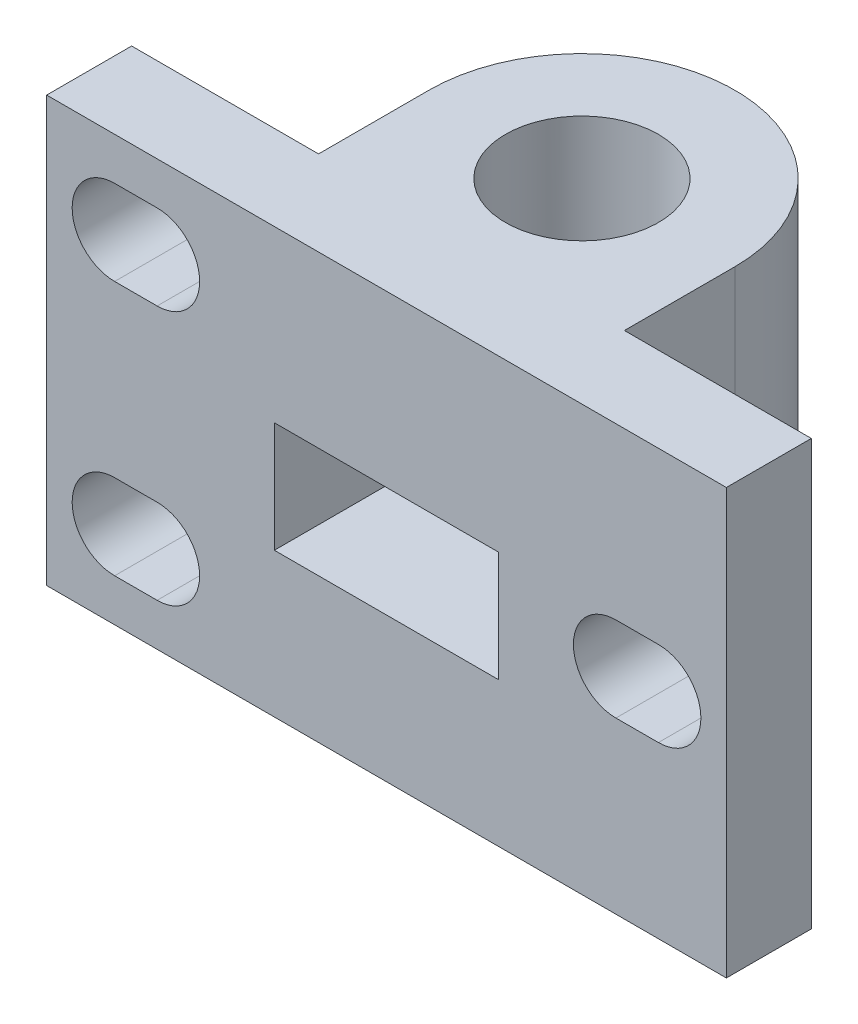
ISO-10303-21;
HEADER;
FILE_DESCRIPTION(('STEP AP214'),'2;1');
FILE_NAME('part.step','',(''),(''),'','','');
FILE_SCHEMA(('AUTOMOTIVE_DESIGN { 1 0 10303 214 1 1 1 1 }'));
ENDSEC;
DATA;
#1=APPLICATION_CONTEXT('core data for automotive mechanical design processes');
#2=APPLICATION_PROTOCOL_DEFINITION('international standard','automotive_design',2000,#1);
#3=PRODUCT_CONTEXT('',#1,'mechanical');
#4=PRODUCT('Part','Part','',(#3));
#5=PRODUCT_RELATED_PRODUCT_CATEGORY('part','',(#4));
#6=PRODUCT_DEFINITION_FORMATION('','',#4);
#7=PRODUCT_DEFINITION_CONTEXT('part definition',#1,'design');
#8=PRODUCT_DEFINITION('design','',#6,#7);
#9=PRODUCT_DEFINITION_SHAPE('','',#8);
#10=(LENGTH_UNIT() NAMED_UNIT(*) SI_UNIT(.MILLI.,.METRE.));
#11=(NAMED_UNIT(*) PLANE_ANGLE_UNIT() SI_UNIT($,.RADIAN.));
#12=(NAMED_UNIT(*) SI_UNIT($,.STERADIAN.) SOLID_ANGLE_UNIT());
#13=UNCERTAINTY_MEASURE_WITH_UNIT(LENGTH_MEASURE(1.E-05),#10,'distance_accuracy_value','');
#14=(GEOMETRIC_REPRESENTATION_CONTEXT(3) GLOBAL_UNCERTAINTY_ASSIGNED_CONTEXT((#13)) GLOBAL_UNIT_ASSIGNED_CONTEXT((#10,
#11,#12)) REPRESENTATION_CONTEXT('',''));
#15=CARTESIAN_POINT('',(0.,0.,0.));
#16=DIRECTION('',(0.,0.,1.));
#17=DIRECTION('',(1.,0.,0.));
#18=AXIS2_PLACEMENT_3D('',#15,#16,#17);
#19=CARTESIAN_POINT('',(0.,25.,-11.5));
#20=DIRECTION('',(0.,-1.,0.));
#21=DIRECTION('',(0.,0.,-1.));
#22=AXIS2_PLACEMENT_3D('',#19,#20,#21);
#23=CYLINDRICAL_SURFACE('',#22,4.5);
#24=CARTESIAN_POINT('',(0.,0.,-11.5));
#25=DIRECTION('',(0.,1.,0.));
#26=DIRECTION('',(0.,0.,-1.));
#27=AXIS2_PLACEMENT_3D('',#24,#25,#26);
#28=CIRCLE('',#27,4.5);
#29=CARTESIAN_POINT('',(0.,0.,-16.));
#30=VERTEX_POINT('',#29);
#31=EDGE_CURVE('E347',#30,#30,#28,.T.);
#32=ORIENTED_EDGE('',*,*,#31,.F.);
#33=EDGE_LOOP('',(#32));
#34=FACE_BOUND('',#33,.T.);
#35=CARTESIAN_POINT('',(0.,8.5,-11.5));
#36=DIRECTION('',(0.,1.,0.));
#37=DIRECTION('',(0.,0.,1.));
#38=AXIS2_PLACEMENT_3D('',#35,#36,#37);
#39=CIRCLE('',#38,4.5);
#40=CARTESIAN_POINT('',(0.,8.5,-7.));
#41=VERTEX_POINT('',#40);
#42=EDGE_CURVE('E37',#41,#41,#39,.T.);
#43=ORIENTED_EDGE('',*,*,#42,.T.);
#44=EDGE_LOOP('',(#43));
#45=FACE_BOUND('',#44,.T.);
#46=ADVANCED_FACE('F33',(#34,#45),#23,.F.);
#47=CARTESIAN_POINT('',(0.,25.,-11.5));
#48=DIRECTION('',(0.,1.,0.));
#49=DIRECTION('',(0.,0.,1.));
#50=AXIS2_PLACEMENT_3D('',#47,#48,#49);
#51=PLANE('',#50);
#52=DIRECTION('',(0.,0.,1.));
#53=VECTOR('',#52,1.);
#54=CARTESIAN_POINT('',(-20.,25.,0.));
#55=LINE('',#54,#53);
#56=CARTESIAN_POINT('',(-20.,25.,-4.99999999999999));
#57=VERTEX_POINT('',#56);
#58=CARTESIAN_POINT('',(-20.,25.,0.));
#59=VERTEX_POINT('',#58);
#60=EDGE_CURVE('E350',#57,#59,#55,.T.);
#61=ORIENTED_EDGE('',*,*,#60,.T.);
#62=DIRECTION('',(1.,0.,0.));
#63=VECTOR('',#62,1.);
#64=CARTESIAN_POINT('',(20.,25.,0.));
#65=LINE('',#64,#63);
#66=CARTESIAN_POINT('',(20.,25.,0.));
#67=VERTEX_POINT('',#66);
#68=EDGE_CURVE('E353',#59,#67,#65,.T.);
#69=ORIENTED_EDGE('',*,*,#68,.T.);
#70=DIRECTION('',(0.,0.,-1.));
#71=VECTOR('',#70,1.);
#72=CARTESIAN_POINT('',(20.,25.,0.));
#73=LINE('',#72,#71);
#74=CARTESIAN_POINT('',(20.,25.,-4.99999999999999));
#75=VERTEX_POINT('',#74);
#76=EDGE_CURVE('E356',#67,#75,#73,.T.);
#77=ORIENTED_EDGE('',*,*,#76,.T.);
#78=DIRECTION('',(-1.,0.,0.));
#79=VECTOR('',#78,1.);
#80=CARTESIAN_POINT('',(9.,25.,-5.));
#81=LINE('',#80,#79);
#82=CARTESIAN_POINT('',(9.,25.,-5.));
#83=VERTEX_POINT('',#82);
#84=EDGE_CURVE('E358',#75,#83,#81,.T.);
#85=ORIENTED_EDGE('',*,*,#84,.T.);
#86=DIRECTION('',(0.,0.,-1.));
#87=VECTOR('',#86,1.);
#88=CARTESIAN_POINT('',(9.,25.,-11.5));
#89=LINE('',#88,#87);
#90=CARTESIAN_POINT('',(9.,25.,-11.5));
#91=VERTEX_POINT('',#90);
#92=EDGE_CURVE('E360',#83,#91,#89,.T.);
#93=ORIENTED_EDGE('',*,*,#92,.T.);
#94=CARTESIAN_POINT('',(0.,25.,-11.5));
#95=DIRECTION('',(0.,1.,0.));
#96=DIRECTION('',(0.,0.,1.));
#97=AXIS2_PLACEMENT_3D('',#94,#95,#96);
#98=CIRCLE('',#97,9.);
#99=CARTESIAN_POINT('',(-9.,25.,-11.5));
#100=VERTEX_POINT('',#99);
#101=EDGE_CURVE('E362',#91,#100,#98,.T.);
#102=ORIENTED_EDGE('',*,*,#101,.T.);
#103=DIRECTION('',(0.,0.,1.));
#104=VECTOR('',#103,1.);
#105=CARTESIAN_POINT('',(-9.,25.,-11.5));
#106=LINE('',#105,#104);
#107=CARTESIAN_POINT('',(-9.,25.,-5.));
#108=VERTEX_POINT('',#107);
#109=EDGE_CURVE('E364',#100,#108,#106,.T.);
#110=ORIENTED_EDGE('',*,*,#109,.T.);
#111=DIRECTION('',(-1.,0.,0.));
#112=VECTOR('',#111,1.);
#113=CARTESIAN_POINT('',(-9.,25.,-5.));
#114=LINE('',#113,#112);
#115=EDGE_CURVE('E366',#108,#57,#114,.T.);
#116=ORIENTED_EDGE('',*,*,#115,.T.);
#117=EDGE_LOOP('',(#61,#69,#77,#85,#93,#102,#110,#116));
#118=FACE_BOUND('',#117,.T.);
#119=CARTESIAN_POINT('',(0.,25.,-11.5));
#120=DIRECTION('',(0.,1.,0.));
#121=DIRECTION('',(0.,0.,-1.));
#122=AXIS2_PLACEMENT_3D('',#119,#120,#121);
#123=CIRCLE('',#122,4.5);
#124=CARTESIAN_POINT('',(0.,25.,-16.));
#125=VERTEX_POINT('',#124);
#126=EDGE_CURVE('E343',#125,#125,#123,.T.);
#127=ORIENTED_EDGE('',*,*,#126,.F.);
#128=EDGE_LOOP('',(#127));
#129=FACE_BOUND('',#128,.T.);
#130=ADVANCED_FACE('F428',(#118,#129),#51,.T.);
#131=CARTESIAN_POINT('',(0.,0.,-11.5));
#132=DIRECTION('',(0.,1.,0.));
#133=DIRECTION('',(0.,0.,1.));
#134=AXIS2_PLACEMENT_3D('',#131,#132,#133);
#135=PLANE('',#134);
#136=DIRECTION('',(0.,0.,1.));
#137=VECTOR('',#136,1.);
#138=CARTESIAN_POINT('',(-20.,0.,0.));
#139=LINE('',#138,#137);
#140=CARTESIAN_POINT('',(-20.,0.,-4.99999999999999));
#141=VERTEX_POINT('',#140);
#142=CARTESIAN_POINT('',(-20.,0.,0.));
#143=VERTEX_POINT('',#142);
#144=EDGE_CURVE('E346',#141,#143,#139,.T.);
#145=ORIENTED_EDGE('',*,*,#144,.F.);
#146=DIRECTION('',(-1.,0.,0.));
#147=VECTOR('',#146,1.);
#148=CARTESIAN_POINT('',(-9.,0.,-5.));
#149=LINE('',#148,#147);
#150=CARTESIAN_POINT('',(-9.,0.,-5.));
#151=VERTEX_POINT('',#150);
#152=EDGE_CURVE('E354',#151,#141,#149,.T.);
#153=ORIENTED_EDGE('',*,*,#152,.F.);
#154=DIRECTION('',(0.,0.,1.));
#155=VECTOR('',#154,1.);
#156=CARTESIAN_POINT('',(-9.,0.,-11.5));
#157=LINE('',#156,#155);
#158=CARTESIAN_POINT('',(-9.,0.,-11.5));
#159=VERTEX_POINT('',#158);
#160=EDGE_CURVE('E381',#159,#151,#157,.T.);
#161=ORIENTED_EDGE('',*,*,#160,.F.);
#162=CARTESIAN_POINT('',(0.,0.,-11.5));
#163=DIRECTION('',(0.,1.,0.));
#164=DIRECTION('',(0.,0.,1.));
#165=AXIS2_PLACEMENT_3D('',#162,#163,#164);
#166=CIRCLE('',#165,9.);
#167=CARTESIAN_POINT('',(9.,0.,-11.5));
#168=VERTEX_POINT('',#167);
#169=EDGE_CURVE('E379',#168,#159,#166,.T.);
#170=ORIENTED_EDGE('',*,*,#169,.F.);
#171=DIRECTION('',(0.,0.,-1.));
#172=VECTOR('',#171,1.);
#173=CARTESIAN_POINT('',(9.,0.,-11.5));
#174=LINE('',#173,#172);
#175=CARTESIAN_POINT('',(9.,0.,-5.));
#176=VERTEX_POINT('',#175);
#177=EDGE_CURVE('E377',#176,#168,#174,.T.);
#178=ORIENTED_EDGE('',*,*,#177,.F.);
#179=DIRECTION('',(-1.,0.,0.));
#180=VECTOR('',#179,1.);
#181=CARTESIAN_POINT('',(9.,0.,-5.));
#182=LINE('',#181,#180);
#183=CARTESIAN_POINT('',(20.,0.,-4.99999999999999));
#184=VERTEX_POINT('',#183);
#185=EDGE_CURVE('E375',#184,#176,#182,.T.);
#186=ORIENTED_EDGE('',*,*,#185,.F.);
#187=DIRECTION('',(0.,0.,-1.));
#188=VECTOR('',#187,1.);
#189=CARTESIAN_POINT('',(20.,0.,0.));
#190=LINE('',#189,#188);
#191=CARTESIAN_POINT('',(20.,0.,0.));
#192=VERTEX_POINT('',#191);
#193=EDGE_CURVE('E373',#192,#184,#190,.T.);
#194=ORIENTED_EDGE('',*,*,#193,.F.);
#195=DIRECTION('',(1.,0.,0.));
#196=VECTOR('',#195,1.);
#197=CARTESIAN_POINT('',(20.,0.,0.));
#198=LINE('',#197,#196);
#199=EDGE_CURVE('E371',#143,#192,#198,.T.);
#200=ORIENTED_EDGE('',*,*,#199,.F.);
#201=EDGE_LOOP('',(#145,#153,#161,#170,#178,#186,#194,#200));
#202=FACE_BOUND('',#201,.T.);
#203=ORIENTED_EDGE('',*,*,#31,.T.);
#204=EDGE_LOOP('',(#203));
#205=FACE_BOUND('',#204,.T.);
#206=ADVANCED_FACE('F435',(#202,#205),#135,.F.);
#207=CARTESIAN_POINT('',(-20.,25.,0.));
#208=DIRECTION('',(1.,0.,0.));
#209=DIRECTION('',(0.,0.,-1.));
#210=AXIS2_PLACEMENT_3D('',#207,#208,#209);
#211=PLANE('',#210);
#212=ORIENTED_EDGE('',*,*,#144,.T.);
#213=DIRECTION('',(0.,-1.,0.));
#214=VECTOR('',#213,1.);
#215=CARTESIAN_POINT('',(-20.,25.,0.));
#216=LINE('',#215,#214);
#217=EDGE_CURVE('E11',#59,#143,#216,.T.);
#218=ORIENTED_EDGE('',*,*,#217,.F.);
#219=ORIENTED_EDGE('',*,*,#60,.F.);
#220=DIRECTION('',(0.,-1.,0.));
#221=VECTOR('',#220,1.);
#222=CARTESIAN_POINT('',(-20.,25.,-4.99999999999999));
#223=LINE('',#222,#221);
#224=EDGE_CURVE('E368',#57,#141,#223,.T.);
#225=ORIENTED_EDGE('',*,*,#224,.T.);
#226=EDGE_LOOP('',(#212,#218,#219,#225));
#227=FACE_BOUND('',#226,.T.);
#228=ADVANCED_FACE('F35',(#227),#211,.F.);
#229=CARTESIAN_POINT('',(20.,25.,0.));
#230=DIRECTION('',(0.,0.,-1.));
#231=DIRECTION('',(-1.,0.,0.));
#232=AXIS2_PLACEMENT_3D('',#229,#230,#231);
#233=PLANE('',#232);
#234=DIRECTION('',(1.,0.,0.));
#235=VECTOR('',#234,1.);
#236=CARTESIAN_POINT('',(-13.5,7.5,0.));
#237=LINE('',#236,#235);
#238=CARTESIAN_POINT('',(-16.,7.5,0.));
#239=VERTEX_POINT('',#238);
#240=CARTESIAN_POINT('',(-13.5,7.5,0.));
#241=VERTEX_POINT('',#240);
#242=EDGE_CURVE('E210',#239,#241,#237,.T.);
#243=ORIENTED_EDGE('',*,*,#242,.T.);
#244=CARTESIAN_POINT('',(-13.5,5.,0.));
#245=DIRECTION('',(0.,0.,-1.));
#246=DIRECTION('',(-1.,0.,0.));
#247=AXIS2_PLACEMENT_3D('',#244,#245,#246);
#248=CIRCLE('',#247,2.5);
#249=CARTESIAN_POINT('',(-13.5,2.5,0.));
#250=VERTEX_POINT('',#249);
#251=EDGE_CURVE('E204',#241,#250,#248,.T.);
#252=ORIENTED_EDGE('',*,*,#251,.T.);
#253=DIRECTION('',(-1.,0.,0.));
#254=VECTOR('',#253,1.);
#255=CARTESIAN_POINT('',(-13.5,2.5,0.));
#256=LINE('',#255,#254);
#257=CARTESIAN_POINT('',(-16.,2.5,0.));
#258=VERTEX_POINT('',#257);
#259=EDGE_CURVE('E213',#250,#258,#256,.T.);
#260=ORIENTED_EDGE('',*,*,#259,.T.);
#261=CARTESIAN_POINT('',(-16.,5.,0.));
#262=DIRECTION('',(0.,0.,-1.));
#263=DIRECTION('',(-1.,0.,0.));
#264=AXIS2_PLACEMENT_3D('',#261,#262,#263);
#265=CIRCLE('',#264,2.5);
#266=EDGE_CURVE('E50',#258,#239,#265,.T.);
#267=ORIENTED_EDGE('',*,*,#266,.T.);
#268=EDGE_LOOP('',(#243,#252,#260,#267));
#269=FACE_BOUND('',#268,.T.);
#270=DIRECTION('',(1.,0.,0.));
#271=VECTOR('',#270,1.);
#272=CARTESIAN_POINT('',(-13.5,22.5,0.));
#273=LINE('',#272,#271);
#274=CARTESIAN_POINT('',(-16.,22.5,0.));
#275=VERTEX_POINT('',#274);
#276=CARTESIAN_POINT('',(-13.5,22.5,0.));
#277=VERTEX_POINT('',#276);
#278=EDGE_CURVE('E249',#275,#277,#273,.T.);
#279=ORIENTED_EDGE('',*,*,#278,.T.);
#280=CARTESIAN_POINT('',(-13.5,20.,0.));
#281=DIRECTION('',(0.,0.,-1.));
#282=DIRECTION('',(-1.,0.,0.));
#283=AXIS2_PLACEMENT_3D('',#280,#281,#282);
#284=CIRCLE('',#283,2.5);
#285=CARTESIAN_POINT('',(-13.5,17.5,0.));
#286=VERTEX_POINT('',#285);
#287=EDGE_CURVE('E239',#277,#286,#284,.T.);
#288=ORIENTED_EDGE('',*,*,#287,.T.);
#289=DIRECTION('',(-1.,0.,0.));
#290=VECTOR('',#289,1.);
#291=CARTESIAN_POINT('',(-13.5,17.5,0.));
#292=LINE('',#291,#290);
#293=CARTESIAN_POINT('',(-16.,17.5,0.));
#294=VERTEX_POINT('',#293);
#295=EDGE_CURVE('E242',#286,#294,#292,.T.);
#296=ORIENTED_EDGE('',*,*,#295,.T.);
#297=CARTESIAN_POINT('',(-16.,20.,0.));
#298=DIRECTION('',(0.,0.,-1.));
#299=DIRECTION('',(-1.,0.,0.));
#300=AXIS2_PLACEMENT_3D('',#297,#298,#299);
#301=CIRCLE('',#300,2.5);
#302=EDGE_CURVE('E246',#294,#275,#301,.T.);
#303=ORIENTED_EDGE('',*,*,#302,.T.);
#304=EDGE_LOOP('',(#279,#288,#296,#303));
#305=FACE_BOUND('',#304,.T.);
#306=DIRECTION('',(1.,0.,0.));
#307=VECTOR('',#306,1.);
#308=CARTESIAN_POINT('',(16.,15.,0.));
#309=LINE('',#308,#307);
#310=CARTESIAN_POINT('',(13.5,15.,0.));
#311=VERTEX_POINT('',#310);
#312=CARTESIAN_POINT('',(16.,15.,0.));
#313=VERTEX_POINT('',#312);
#314=EDGE_CURVE('E281',#311,#313,#309,.T.);
#315=ORIENTED_EDGE('',*,*,#314,.T.);
#316=CARTESIAN_POINT('',(16.,12.5,0.));
#317=DIRECTION('',(0.,0.,-1.));
#318=DIRECTION('',(-1.,0.,0.));
#319=AXIS2_PLACEMENT_3D('',#316,#317,#318);
#320=CIRCLE('',#319,2.5);
#321=CARTESIAN_POINT('',(16.,10.,0.));
#322=VERTEX_POINT('',#321);
#323=EDGE_CURVE('E271',#313,#322,#320,.T.);
#324=ORIENTED_EDGE('',*,*,#323,.T.);
#325=DIRECTION('',(-1.,0.,0.));
#326=VECTOR('',#325,1.);
#327=CARTESIAN_POINT('',(16.,10.,0.));
#328=LINE('',#327,#326);
#329=CARTESIAN_POINT('',(13.5,10.,0.));
#330=VERTEX_POINT('',#329);
#331=EDGE_CURVE('E274',#322,#330,#328,.T.);
#332=ORIENTED_EDGE('',*,*,#331,.T.);
#333=CARTESIAN_POINT('',(13.5,12.5,0.));
#334=DIRECTION('',(0.,0.,-1.));
#335=DIRECTION('',(-1.,0.,0.));
#336=AXIS2_PLACEMENT_3D('',#333,#334,#335);
#337=CIRCLE('',#336,2.5);
#338=EDGE_CURVE('E278',#330,#311,#337,.T.);
#339=ORIENTED_EDGE('',*,*,#338,.T.);
#340=EDGE_LOOP('',(#315,#324,#332,#339));
#341=FACE_BOUND('',#340,.T.);
#342=DIRECTION('',(-1.,0.,0.));
#343=VECTOR('',#342,1.);
#344=CARTESIAN_POINT('',(-6.6,8.5,0.));
#345=LINE('',#344,#343);
#346=CARTESIAN_POINT('',(6.6,8.5,0.));
#347=VERTEX_POINT('',#346);
#348=CARTESIAN_POINT('',(-6.6,8.5,0.));
#349=VERTEX_POINT('',#348);
#350=EDGE_CURVE('E311',#347,#349,#345,.T.);
#351=ORIENTED_EDGE('',*,*,#350,.T.);
#352=DIRECTION('',(0.,1.,0.));
#353=VECTOR('',#352,1.);
#354=CARTESIAN_POINT('',(-6.6,15.,0.));
#355=LINE('',#354,#353);
#356=CARTESIAN_POINT('',(-6.6,15.,0.));
#357=VERTEX_POINT('',#356);
#358=EDGE_CURVE('E296',#349,#357,#355,.T.);
#359=ORIENTED_EDGE('',*,*,#358,.T.);
#360=DIRECTION('',(1.,0.,0.));
#361=VECTOR('',#360,1.);
#362=CARTESIAN_POINT('',(-6.6,15.,0.));
#363=LINE('',#362,#361);
#364=CARTESIAN_POINT('',(6.6,15.,0.));
#365=VERTEX_POINT('',#364);
#366=EDGE_CURVE('E305',#357,#365,#363,.T.);
#367=ORIENTED_EDGE('',*,*,#366,.T.);
#368=DIRECTION('',(0.,-1.,0.));
#369=VECTOR('',#368,1.);
#370=CARTESIAN_POINT('',(6.6,15.,0.));
#371=LINE('',#370,#369);
#372=EDGE_CURVE('E308',#365,#347,#371,.T.);
#373=ORIENTED_EDGE('',*,*,#372,.T.);
#374=EDGE_LOOP('',(#351,#359,#367,#373));
#375=FACE_BOUND('',#374,.T.);
#376=ORIENTED_EDGE('',*,*,#199,.T.);
#377=DIRECTION('',(0.,-1.,0.));
#378=VECTOR('',#377,1.);
#379=CARTESIAN_POINT('',(20.,25.,0.));
#380=LINE('',#379,#378);
#381=EDGE_CURVE('E42',#67,#192,#380,.T.);
#382=ORIENTED_EDGE('',*,*,#381,.F.);
#383=ORIENTED_EDGE('',*,*,#68,.F.);
#384=ORIENTED_EDGE('',*,*,#217,.T.);
#385=EDGE_LOOP('',(#376,#382,#383,#384));
#386=FACE_BOUND('',#385,.T.);
#387=ADVANCED_FACE('F217',(#269,#305,#341,#375,#386),#233,.F.);
#388=CARTESIAN_POINT('',(20.,25.,0.));
#389=DIRECTION('',(-1.,0.,0.));
#390=DIRECTION('',(0.,0.,1.));
#391=AXIS2_PLACEMENT_3D('',#388,#389,#390);
#392=PLANE('',#391);
#393=ORIENTED_EDGE('',*,*,#193,.T.);
#394=DIRECTION('',(0.,-1.,0.));
#395=VECTOR('',#394,1.);
#396=CARTESIAN_POINT('',(20.,25.,-4.99999999999999));
#397=LINE('',#396,#395);
#398=EDGE_CURVE('E398',#75,#184,#397,.T.);
#399=ORIENTED_EDGE('',*,*,#398,.F.);
#400=ORIENTED_EDGE('',*,*,#76,.F.);
#401=ORIENTED_EDGE('',*,*,#381,.T.);
#402=EDGE_LOOP('',(#393,#399,#400,#401));
#403=FACE_BOUND('',#402,.T.);
#404=ADVANCED_FACE('F475',(#403),#392,.F.);
#405=CARTESIAN_POINT('',(9.,25.,-5.));
#406=DIRECTION('',(0.,0.,1.));
#407=DIRECTION('',(1.,0.,0.));
#408=AXIS2_PLACEMENT_3D('',#405,#406,#407);
#409=PLANE('',#408);
#410=DIRECTION('',(-1.,0.,0.));
#411=VECTOR('',#410,1.);
#412=CARTESIAN_POINT('',(16.,10.,-5.));
#413=LINE('',#412,#411);
#414=CARTESIAN_POINT('',(16.,10.,-5.));
#415=VERTEX_POINT('',#414);
#416=CARTESIAN_POINT('',(13.5,10.,-5.));
#417=VERTEX_POINT('',#416);
#418=EDGE_CURVE('E286',#415,#417,#413,.T.);
#419=ORIENTED_EDGE('',*,*,#418,.F.);
#420=CARTESIAN_POINT('',(16.,12.5,-5.));
#421=DIRECTION('',(0.,0.,-1.));
#422=DIRECTION('',(-1.,0.,0.));
#423=AXIS2_PLACEMENT_3D('',#420,#421,#422);
#424=CIRCLE('',#423,2.5);
#425=CARTESIAN_POINT('',(16.,15.,-5.));
#426=VERTEX_POINT('',#425);
#427=EDGE_CURVE('E264',#426,#415,#424,.T.);
#428=ORIENTED_EDGE('',*,*,#427,.F.);
#429=DIRECTION('',(1.,0.,0.));
#430=VECTOR('',#429,1.);
#431=CARTESIAN_POINT('',(16.,15.,-5.));
#432=LINE('',#431,#430);
#433=CARTESIAN_POINT('',(13.5,15.,-5.));
#434=VERTEX_POINT('',#433);
#435=EDGE_CURVE('E275',#434,#426,#432,.T.);
#436=ORIENTED_EDGE('',*,*,#435,.F.);
#437=CARTESIAN_POINT('',(13.5,12.5,-5.));
#438=DIRECTION('',(0.,0.,-1.));
#439=DIRECTION('',(-1.,0.,0.));
#440=AXIS2_PLACEMENT_3D('',#437,#438,#439);
#441=CIRCLE('',#440,2.5);
#442=EDGE_CURVE('E289',#417,#434,#441,.T.);
#443=ORIENTED_EDGE('',*,*,#442,.F.);
#444=EDGE_LOOP('',(#419,#428,#436,#443));
#445=FACE_BOUND('',#444,.T.);
#446=ORIENTED_EDGE('',*,*,#185,.T.);
#447=DIRECTION('',(0.,-1.,0.));
#448=VECTOR('',#447,1.);
#449=CARTESIAN_POINT('',(9.,25.,-5.));
#450=LINE('',#449,#448);
#451=EDGE_CURVE('E395',#83,#176,#450,.T.);
#452=ORIENTED_EDGE('',*,*,#451,.F.);
#453=ORIENTED_EDGE('',*,*,#84,.F.);
#454=ORIENTED_EDGE('',*,*,#398,.T.);
#455=EDGE_LOOP('',(#446,#452,#453,#454));
#456=FACE_BOUND('',#455,.T.);
#457=ADVANCED_FACE('F471',(#445,#456),#409,.F.);
#458=CARTESIAN_POINT('',(9.,25.,-11.5));
#459=DIRECTION('',(-1.,0.,0.));
#460=DIRECTION('',(0.,0.,1.));
#461=AXIS2_PLACEMENT_3D('',#458,#459,#460);
#462=PLANE('',#461);
#463=ORIENTED_EDGE('',*,*,#177,.T.);
#464=DIRECTION('',(0.,-1.,0.));
#465=VECTOR('',#464,1.);
#466=CARTESIAN_POINT('',(9.,25.,-11.5));
#467=LINE('',#466,#465);
#468=EDGE_CURVE('E392',#91,#168,#467,.T.);
#469=ORIENTED_EDGE('',*,*,#468,.F.);
#470=ORIENTED_EDGE('',*,*,#92,.F.);
#471=ORIENTED_EDGE('',*,*,#451,.T.);
#472=EDGE_LOOP('',(#463,#469,#470,#471));
#473=FACE_BOUND('',#472,.T.);
#474=ADVANCED_FACE('F467',(#473),#462,.F.);
#475=CARTESIAN_POINT('',(0.,25.,-11.5));
#476=DIRECTION('',(0.,-1.,0.));
#477=DIRECTION('',(0.,0.,-1.));
#478=AXIS2_PLACEMENT_3D('',#475,#476,#477);
#479=CYLINDRICAL_SURFACE('',#478,9.);
#480=ORIENTED_EDGE('',*,*,#169,.T.);
#481=DIRECTION('',(0.,-1.,0.));
#482=VECTOR('',#481,1.);
#483=CARTESIAN_POINT('',(-9.,25.,-11.5));
#484=LINE('',#483,#482);
#485=EDGE_CURVE('E389',#100,#159,#484,.T.);
#486=ORIENTED_EDGE('',*,*,#485,.F.);
#487=ORIENTED_EDGE('',*,*,#101,.F.);
#488=ORIENTED_EDGE('',*,*,#468,.T.);
#489=EDGE_LOOP('',(#480,#486,#487,#488));
#490=FACE_BOUND('',#489,.T.);
#491=ADVANCED_FACE('F459',(#490),#479,.T.);
#492=CARTESIAN_POINT('',(-9.,25.,-11.5));
#493=DIRECTION('',(1.,0.,0.));
#494=DIRECTION('',(0.,0.,-1.));
#495=AXIS2_PLACEMENT_3D('',#492,#493,#494);
#496=PLANE('',#495);
#497=ORIENTED_EDGE('',*,*,#160,.T.);
#498=DIRECTION('',(0.,-1.,0.));
#499=VECTOR('',#498,1.);
#500=CARTESIAN_POINT('',(-9.,25.,-5.));
#501=LINE('',#500,#499);
#502=EDGE_CURVE('E386',#108,#151,#501,.T.);
#503=ORIENTED_EDGE('',*,*,#502,.F.);
#504=ORIENTED_EDGE('',*,*,#109,.F.);
#505=ORIENTED_EDGE('',*,*,#485,.T.);
#506=EDGE_LOOP('',(#497,#503,#504,#505));
#507=FACE_BOUND('',#506,.T.);
#508=ADVANCED_FACE('F450',(#507),#496,.F.);
#509=CARTESIAN_POINT('',(-9.,25.,-5.));
#510=DIRECTION('',(0.,0.,1.));
#511=DIRECTION('',(1.,0.,0.));
#512=AXIS2_PLACEMENT_3D('',#509,#510,#511);
#513=PLANE('',#512);
#514=DIRECTION('',(-1.,0.,0.));
#515=VECTOR('',#514,1.);
#516=CARTESIAN_POINT('',(-13.5,2.5,-5.00000000000002));
#517=LINE('',#516,#515);
#518=CARTESIAN_POINT('',(-13.5,2.5,-5.));
#519=VERTEX_POINT('',#518);
#520=CARTESIAN_POINT('',(-16.,2.5,-5.00000000000002));
#521=VERTEX_POINT('',#520);
#522=EDGE_CURVE('E229',#519,#521,#517,.T.);
#523=ORIENTED_EDGE('',*,*,#522,.F.);
#524=CARTESIAN_POINT('',(-13.5,5.,-5.00000000000002));
#525=DIRECTION('',(0.,0.,-1.));
#526=DIRECTION('',(-1.,0.,0.));
#527=AXIS2_PLACEMENT_3D('',#524,#525,#526);
#528=CIRCLE('',#527,2.5);
#529=CARTESIAN_POINT('',(-13.5,7.5,-5.00000000000002));
#530=VERTEX_POINT('',#529);
#531=EDGE_CURVE('E58',#530,#519,#528,.T.);
#532=ORIENTED_EDGE('',*,*,#531,.F.);
#533=DIRECTION('',(1.,0.,0.));
#534=VECTOR('',#533,1.);
#535=CARTESIAN_POINT('',(-13.5,7.5,-5.00000000000002));
#536=LINE('',#535,#534);
#537=CARTESIAN_POINT('',(-16.,7.5,-5.00000000000002));
#538=VERTEX_POINT('',#537);
#539=EDGE_CURVE('E220',#538,#530,#536,.T.);
#540=ORIENTED_EDGE('',*,*,#539,.F.);
#541=CARTESIAN_POINT('',(-16.,5.,-5.00000000000002));
#542=DIRECTION('',(0.,0.,-1.));
#543=DIRECTION('',(-1.,0.,0.));
#544=AXIS2_PLACEMENT_3D('',#541,#542,#543);
#545=CIRCLE('',#544,2.5);
#546=EDGE_CURVE('E223',#521,#538,#545,.T.);
#547=ORIENTED_EDGE('',*,*,#546,.F.);
#548=EDGE_LOOP('',(#523,#532,#540,#547));
#549=FACE_BOUND('',#548,.T.);
#550=DIRECTION('',(-1.,0.,0.));
#551=VECTOR('',#550,1.);
#552=CARTESIAN_POINT('',(-13.5,17.5,-5.00000000000002));
#553=LINE('',#552,#551);
#554=CARTESIAN_POINT('',(-13.5,17.5,-5.));
#555=VERTEX_POINT('',#554);
#556=CARTESIAN_POINT('',(-16.,17.5,-5.00000000000002));
#557=VERTEX_POINT('',#556);
#558=EDGE_CURVE('E254',#555,#557,#553,.T.);
#559=ORIENTED_EDGE('',*,*,#558,.F.);
#560=CARTESIAN_POINT('',(-13.5,20.,-5.00000000000002));
#561=DIRECTION('',(0.,0.,-1.));
#562=DIRECTION('',(-1.,0.,0.));
#563=AXIS2_PLACEMENT_3D('',#560,#561,#562);
#564=CIRCLE('',#563,2.5);
#565=CARTESIAN_POINT('',(-13.5,22.5,-5.00000000000002));
#566=VERTEX_POINT('',#565);
#567=EDGE_CURVE('E235',#566,#555,#564,.T.);
#568=ORIENTED_EDGE('',*,*,#567,.F.);
#569=DIRECTION('',(1.,0.,0.));
#570=VECTOR('',#569,1.);
#571=CARTESIAN_POINT('',(-13.5,22.5,-5.00000000000002));
#572=LINE('',#571,#570);
#573=CARTESIAN_POINT('',(-16.,22.5,-5.00000000000002));
#574=VERTEX_POINT('',#573);
#575=EDGE_CURVE('E243',#574,#566,#572,.T.);
#576=ORIENTED_EDGE('',*,*,#575,.F.);
#577=CARTESIAN_POINT('',(-16.,20.,-5.00000000000002));
#578=DIRECTION('',(0.,0.,-1.));
#579=DIRECTION('',(-1.,0.,0.));
#580=AXIS2_PLACEMENT_3D('',#577,#578,#579);
#581=CIRCLE('',#580,2.5);
#582=EDGE_CURVE('E257',#557,#574,#581,.T.);
#583=ORIENTED_EDGE('',*,*,#582,.F.);
#584=EDGE_LOOP('',(#559,#568,#576,#583));
#585=FACE_BOUND('',#584,.T.);
#586=ORIENTED_EDGE('',*,*,#152,.T.);
#587=ORIENTED_EDGE('',*,*,#224,.F.);
#588=ORIENTED_EDGE('',*,*,#115,.F.);
#589=ORIENTED_EDGE('',*,*,#502,.T.);
#590=EDGE_LOOP('',(#586,#587,#588,#589));
#591=FACE_BOUND('',#590,.T.);
#592=ADVANCED_FACE('F442',(#549,#585,#591),#513,.F.);
#593=CARTESIAN_POINT('',(0.,15.,-11.5));
#594=DIRECTION('',(0.,1.,0.));
#595=DIRECTION('',(0.,0.,1.));
#596=AXIS2_PLACEMENT_3D('',#593,#594,#595);
#597=CIRCLE('',#596,4.5);
#598=CARTESIAN_POINT('',(0.,15.,-7.));
#599=VERTEX_POINT('',#598);
#600=EDGE_CURVE('E339',#599,#599,#597,.T.);
#601=ORIENTED_EDGE('',*,*,#600,.F.);
#602=EDGE_LOOP('',(#601));
#603=FACE_BOUND('',#602,.T.);
#604=ORIENTED_EDGE('',*,*,#126,.T.);
#605=EDGE_LOOP('',(#604));
#606=FACE_BOUND('',#605,.T.);
#607=ADVANCED_FACE('F431',(#603,#606),#23,.F.);
#608=CARTESIAN_POINT('',(6.6,8.5,-15.3105117766515));
#609=DIRECTION('',(0.5,0.,-0.866025403784438));
#610=DIRECTION('',(-0.866025403784439,0.,-0.5));
#611=AXIS2_PLACEMENT_3D('',#608,#609,#610);
#612=PLANE('',#611);
#613=DIRECTION('',(-0.866025403784438,0.,-0.5));
#614=VECTOR('',#613,1.);
#615=CARTESIAN_POINT('',(6.6,15.,-15.3105117766515));
#616=LINE('',#615,#614);
#617=CARTESIAN_POINT('',(6.6,15.,-15.3105117766515));
#618=VERTEX_POINT('',#617);
#619=CARTESIAN_POINT('',(0.,15.,-19.1210235533031));
#620=VERTEX_POINT('',#619);
#621=EDGE_CURVE('E314',#618,#620,#616,.T.);
#622=ORIENTED_EDGE('',*,*,#621,.T.);
#623=DIRECTION('',(0.,1.,0.));
#624=VECTOR('',#623,1.);
#625=CARTESIAN_POINT('',(0.,8.5,-19.1210235533031));
#626=LINE('',#625,#624);
#627=CARTESIAN_POINT('',(0.,8.5,-19.1210235533031));
#628=VERTEX_POINT('',#627);
#629=EDGE_CURVE('E327',#628,#620,#626,.T.);
#630=ORIENTED_EDGE('',*,*,#629,.F.);
#631=DIRECTION('',(-0.866025403784438,0.,-0.5));
#632=VECTOR('',#631,1.);
#633=CARTESIAN_POINT('',(6.6,8.5,-15.3105117766515));
#634=LINE('',#633,#632);
#635=CARTESIAN_POINT('',(6.6,8.5,-15.3105117766515));
#636=VERTEX_POINT('',#635);
#637=EDGE_CURVE('E315',#636,#628,#634,.T.);
#638=ORIENTED_EDGE('',*,*,#637,.F.);
#639=DIRECTION('',(0.,1.,0.));
#640=VECTOR('',#639,1.);
#641=CARTESIAN_POINT('',(6.6,8.5,-15.3105117766515));
#642=LINE('',#641,#640);
#643=EDGE_CURVE('E337',#636,#618,#642,.T.);
#644=ORIENTED_EDGE('',*,*,#643,.T.);
#645=EDGE_LOOP('',(#622,#630,#638,#644));
#646=FACE_BOUND('',#645,.T.);
#647=ADVANCED_FACE('F441',(#646),#612,.F.);
#648=CARTESIAN_POINT('',(6.6,8.5,-7.68948822334847));
#649=DIRECTION('',(1.,0.,0.));
#650=DIRECTION('',(0.,0.,-1.));
#651=AXIS2_PLACEMENT_3D('',#648,#649,#650);
#652=PLANE('',#651);
#653=DIRECTION('',(0.,0.,-1.));
#654=VECTOR('',#653,1.);
#655=CARTESIAN_POINT('',(6.6,15.,-7.68948822334847));
#656=LINE('',#655,#654);
#657=EDGE_CURVE('E319',#365,#618,#656,.T.);
#658=ORIENTED_EDGE('',*,*,#657,.T.);
#659=ORIENTED_EDGE('',*,*,#643,.F.);
#660=DIRECTION('',(0.,0.,-1.));
#661=VECTOR('',#660,1.);
#662=CARTESIAN_POINT('',(6.6,8.5,-7.68948822334847));
#663=LINE('',#662,#661);
#664=EDGE_CURVE('E324',#347,#636,#663,.T.);
#665=ORIENTED_EDGE('',*,*,#664,.F.);
#666=ORIENTED_EDGE('',*,*,#372,.F.);
#667=EDGE_LOOP('',(#658,#659,#665,#666));
#668=FACE_BOUND('',#667,.T.);
#669=ADVANCED_FACE('F448',(#668),#652,.F.);
#670=CARTESIAN_POINT('',(-6.6,8.5,-15.3105117766515));
#671=DIRECTION('',(-1.,0.,0.));
#672=DIRECTION('',(0.,0.,1.));
#673=AXIS2_PLACEMENT_3D('',#670,#671,#672);
#674=PLANE('',#673);
#675=DIRECTION('',(0.,0.,1.));
#676=VECTOR('',#675,1.);
#677=CARTESIAN_POINT('',(-6.6,15.,-15.3105117766515));
#678=LINE('',#677,#676);
#679=CARTESIAN_POINT('',(-6.6,15.,-15.3105117766515));
#680=VERTEX_POINT('',#679);
#681=EDGE_CURVE('E333',#680,#357,#678,.T.);
#682=ORIENTED_EDGE('',*,*,#681,.T.);
#683=ORIENTED_EDGE('',*,*,#358,.F.);
#684=DIRECTION('',(0.,0.,1.));
#685=VECTOR('',#684,1.);
#686=CARTESIAN_POINT('',(-6.6,8.5,-15.3105117766515));
#687=LINE('',#686,#685);
#688=CARTESIAN_POINT('',(-6.6,8.5,-15.3105117766515));
#689=VERTEX_POINT('',#688);
#690=EDGE_CURVE('E322',#689,#349,#687,.T.);
#691=ORIENTED_EDGE('',*,*,#690,.F.);
#692=DIRECTION('',(0.,1.,0.));
#693=VECTOR('',#692,1.);
#694=CARTESIAN_POINT('',(-6.6,8.5,-15.3105117766515));
#695=LINE('',#694,#693);
#696=EDGE_CURVE('E340',#689,#680,#695,.T.);
#697=ORIENTED_EDGE('',*,*,#696,.T.);
#698=EDGE_LOOP('',(#682,#683,#691,#697));
#699=FACE_BOUND('',#698,.T.);
#700=ADVANCED_FACE('F422',(#699),#674,.F.);
#701=CARTESIAN_POINT('',(0.,8.5,-19.1210235533031));
#702=DIRECTION('',(-0.5,0.,-0.866025403784438));
#703=DIRECTION('',(-0.866025403784439,0.,0.5));
#704=AXIS2_PLACEMENT_3D('',#701,#702,#703);
#705=PLANE('',#704);
#706=DIRECTION('',(-0.866025403784439,0.,0.5));
#707=VECTOR('',#706,1.);
#708=CARTESIAN_POINT('',(0.,15.,-19.1210235533031));
#709=LINE('',#708,#707);
#710=EDGE_CURVE('E330',#620,#680,#709,.T.);
#711=ORIENTED_EDGE('',*,*,#710,.T.);
#712=ORIENTED_EDGE('',*,*,#696,.F.);
#713=DIRECTION('',(-0.866025403784439,0.,0.5));
#714=VECTOR('',#713,1.);
#715=CARTESIAN_POINT('',(0.,8.5,-19.1210235533031));
#716=LINE('',#715,#714);
#717=EDGE_CURVE('E318',#628,#689,#716,.T.);
#718=ORIENTED_EDGE('',*,*,#717,.F.);
#719=ORIENTED_EDGE('',*,*,#629,.T.);
#720=EDGE_LOOP('',(#711,#712,#718,#719));
#721=FACE_BOUND('',#720,.T.);
#722=ADVANCED_FACE('F412',(#721),#705,.F.);
#723=CARTESIAN_POINT('',(0.,8.5,0.));
#724=DIRECTION('',(0.,1.,0.));
#725=DIRECTION('',(0.,0.,1.));
#726=AXIS2_PLACEMENT_3D('',#723,#724,#725);
#727=PLANE('',#726);
#728=ORIENTED_EDGE('',*,*,#350,.F.);
#729=ORIENTED_EDGE('',*,*,#664,.T.);
#730=ORIENTED_EDGE('',*,*,#637,.T.);
#731=ORIENTED_EDGE('',*,*,#717,.T.);
#732=ORIENTED_EDGE('',*,*,#690,.T.);
#733=EDGE_LOOP('',(#728,#729,#730,#731,#732));
#734=FACE_BOUND('',#733,.T.);
#735=ORIENTED_EDGE('',*,*,#42,.F.);
#736=EDGE_LOOP('',(#735));
#737=FACE_BOUND('',#736,.T.);
#738=ADVANCED_FACE('F409',(#734,#737),#727,.T.);
#739=CARTESIAN_POINT('',(0.,15.,0.));
#740=DIRECTION('',(0.,1.,0.));
#741=DIRECTION('',(0.,0.,1.));
#742=AXIS2_PLACEMENT_3D('',#739,#740,#741);
#743=PLANE('',#742);
#744=ORIENTED_EDGE('',*,*,#657,.F.);
#745=ORIENTED_EDGE('',*,*,#366,.F.);
#746=ORIENTED_EDGE('',*,*,#681,.F.);
#747=ORIENTED_EDGE('',*,*,#710,.F.);
#748=ORIENTED_EDGE('',*,*,#621,.F.);
#749=EDGE_LOOP('',(#744,#745,#746,#747,#748));
#750=FACE_BOUND('',#749,.T.);
#751=ORIENTED_EDGE('',*,*,#600,.T.);
#752=EDGE_LOOP('',(#751));
#753=FACE_BOUND('',#752,.T.);
#754=ADVANCED_FACE('F411',(#750,#753),#743,.F.);
#755=CARTESIAN_POINT('',(16.,12.5,0.));
#756=DIRECTION('',(0.,0.,-1.));
#757=DIRECTION('',(-1.,0.,0.));
#758=AXIS2_PLACEMENT_3D('',#755,#756,#757);
#759=CYLINDRICAL_SURFACE('',#758,2.5);
#760=ORIENTED_EDGE('',*,*,#427,.T.);
#761=DIRECTION('',(0.,0.,-1.));
#762=VECTOR('',#761,1.);
#763=CARTESIAN_POINT('',(16.,10.,0.));
#764=LINE('',#763,#762);
#765=EDGE_CURVE('E284',#322,#415,#764,.T.);
#766=ORIENTED_EDGE('',*,*,#765,.F.);
#767=ORIENTED_EDGE('',*,*,#323,.F.);
#768=DIRECTION('',(0.,0.,-1.));
#769=VECTOR('',#768,1.);
#770=CARTESIAN_POINT('',(16.,15.,0.));
#771=LINE('',#770,#769);
#772=EDGE_CURVE('E294',#313,#426,#771,.T.);
#773=ORIENTED_EDGE('',*,*,#772,.T.);
#774=EDGE_LOOP('',(#760,#766,#767,#773));
#775=FACE_BOUND('',#774,.T.);
#776=ADVANCED_FACE('F419',(#775),#759,.F.);
#777=CARTESIAN_POINT('',(16.,15.,0.));
#778=DIRECTION('',(0.,1.,0.));
#779=DIRECTION('',(-1.,0.,0.));
#780=AXIS2_PLACEMENT_3D('',#777,#778,#779);
#781=PLANE('',#780);
#782=ORIENTED_EDGE('',*,*,#435,.T.);
#783=ORIENTED_EDGE('',*,*,#772,.F.);
#784=ORIENTED_EDGE('',*,*,#314,.F.);
#785=DIRECTION('',(0.,0.,-1.));
#786=VECTOR('',#785,1.);
#787=CARTESIAN_POINT('',(13.5,15.,0.));
#788=LINE('',#787,#786);
#789=EDGE_CURVE('E297',#311,#434,#788,.T.);
#790=ORIENTED_EDGE('',*,*,#789,.T.);
#791=EDGE_LOOP('',(#782,#783,#784,#790));
#792=FACE_BOUND('',#791,.T.);
#793=ADVANCED_FACE('F621',(#792),#781,.F.);
#794=CARTESIAN_POINT('',(13.5,12.5,0.));
#795=DIRECTION('',(0.,0.,-1.));
#796=DIRECTION('',(-1.,0.,0.));
#797=AXIS2_PLACEMENT_3D('',#794,#795,#796);
#798=CYLINDRICAL_SURFACE('',#797,2.5);
#799=ORIENTED_EDGE('',*,*,#442,.T.);
#800=ORIENTED_EDGE('',*,*,#789,.F.);
#801=ORIENTED_EDGE('',*,*,#338,.F.);
#802=DIRECTION('',(0.,0.,-1.));
#803=VECTOR('',#802,1.);
#804=CARTESIAN_POINT('',(13.5,10.,0.));
#805=LINE('',#804,#803);
#806=EDGE_CURVE('E299',#330,#417,#805,.T.);
#807=ORIENTED_EDGE('',*,*,#806,.T.);
#808=EDGE_LOOP('',(#799,#800,#801,#807));
#809=FACE_BOUND('',#808,.T.);
#810=ADVANCED_FACE('F629',(#809),#798,.F.);
#811=CARTESIAN_POINT('',(16.,10.,0.));
#812=DIRECTION('',(0.,-1.,0.));
#813=DIRECTION('',(1.,0.,0.));
#814=AXIS2_PLACEMENT_3D('',#811,#812,#813);
#815=PLANE('',#814);
#816=ORIENTED_EDGE('',*,*,#418,.T.);
#817=ORIENTED_EDGE('',*,*,#806,.F.);
#818=ORIENTED_EDGE('',*,*,#331,.F.);
#819=ORIENTED_EDGE('',*,*,#765,.T.);
#820=EDGE_LOOP('',(#816,#817,#818,#819));
#821=FACE_BOUND('',#820,.T.);
#822=ADVANCED_FACE('F638',(#821),#815,.F.);
#823=CARTESIAN_POINT('',(-13.5,20.,0.));
#824=DIRECTION('',(0.,0.,-1.));
#825=DIRECTION('',(-1.,0.,0.));
#826=AXIS2_PLACEMENT_3D('',#823,#824,#825);
#827=CYLINDRICAL_SURFACE('',#826,2.5);
#828=ORIENTED_EDGE('',*,*,#567,.T.);
#829=DIRECTION('',(0.,0.,-1.));
#830=VECTOR('',#829,1.);
#831=CARTESIAN_POINT('',(-13.5,17.5,0.));
#832=LINE('',#831,#830);
#833=EDGE_CURVE('E252',#286,#555,#832,.T.);
#834=ORIENTED_EDGE('',*,*,#833,.F.);
#835=ORIENTED_EDGE('',*,*,#287,.F.);
#836=DIRECTION('',(0.,0.,-1.));
#837=VECTOR('',#836,1.);
#838=CARTESIAN_POINT('',(-13.5,22.5,0.));
#839=LINE('',#838,#837);
#840=EDGE_CURVE('E262',#277,#566,#839,.T.);
#841=ORIENTED_EDGE('',*,*,#840,.T.);
#842=EDGE_LOOP('',(#828,#834,#835,#841));
#843=FACE_BOUND('',#842,.T.);
#844=ADVANCED_FACE('F647',(#843),#827,.F.);
#845=CARTESIAN_POINT('',(-13.5,22.5,0.));
#846=DIRECTION('',(0.,1.,0.));
#847=DIRECTION('',(0.,0.,1.));
#848=AXIS2_PLACEMENT_3D('',#845,#846,#847);
#849=PLANE('',#848);
#850=ORIENTED_EDGE('',*,*,#575,.T.);
#851=ORIENTED_EDGE('',*,*,#840,.F.);
#852=ORIENTED_EDGE('',*,*,#278,.F.);
#853=DIRECTION('',(0.,0.,-1.));
#854=VECTOR('',#853,1.);
#855=CARTESIAN_POINT('',(-16.,22.5,0.));
#856=LINE('',#855,#854);
#857=EDGE_CURVE('E265',#275,#574,#856,.T.);
#858=ORIENTED_EDGE('',*,*,#857,.T.);
#859=EDGE_LOOP('',(#850,#851,#852,#858));
#860=FACE_BOUND('',#859,.T.);
#861=ADVANCED_FACE('F656',(#860),#849,.F.);
#862=CARTESIAN_POINT('',(-16.,20.,0.));
#863=DIRECTION('',(0.,0.,-1.));
#864=DIRECTION('',(-1.,0.,0.));
#865=AXIS2_PLACEMENT_3D('',#862,#863,#864);
#866=CYLINDRICAL_SURFACE('',#865,2.5);
#867=ORIENTED_EDGE('',*,*,#582,.T.);
#868=ORIENTED_EDGE('',*,*,#857,.F.);
#869=ORIENTED_EDGE('',*,*,#302,.F.);
#870=DIRECTION('',(0.,0.,-1.));
#871=VECTOR('',#870,1.);
#872=CARTESIAN_POINT('',(-16.,17.5,0.));
#873=LINE('',#872,#871);
#874=EDGE_CURVE('E267',#294,#557,#873,.T.);
#875=ORIENTED_EDGE('',*,*,#874,.T.);
#876=EDGE_LOOP('',(#867,#868,#869,#875));
#877=FACE_BOUND('',#876,.T.);
#878=ADVANCED_FACE('F665',(#877),#866,.F.);
#879=CARTESIAN_POINT('',(-13.5,17.5,0.));
#880=DIRECTION('',(0.,-1.,0.));
#881=DIRECTION('',(0.,0.,-1.));
#882=AXIS2_PLACEMENT_3D('',#879,#880,#881);
#883=PLANE('',#882);
#884=ORIENTED_EDGE('',*,*,#558,.T.);
#885=ORIENTED_EDGE('',*,*,#874,.F.);
#886=ORIENTED_EDGE('',*,*,#295,.F.);
#887=ORIENTED_EDGE('',*,*,#833,.T.);
#888=EDGE_LOOP('',(#884,#885,#886,#887));
#889=FACE_BOUND('',#888,.T.);
#890=ADVANCED_FACE('F674',(#889),#883,.F.);
#891=CARTESIAN_POINT('',(-13.5,5.,0.));
#892=DIRECTION('',(0.,0.,-1.));
#893=DIRECTION('',(-1.,0.,0.));
#894=AXIS2_PLACEMENT_3D('',#891,#892,#893);
#895=CYLINDRICAL_SURFACE('',#894,2.5);
#896=ORIENTED_EDGE('',*,*,#531,.T.);
#897=DIRECTION('',(0.,0.,-1.));
#898=VECTOR('',#897,1.);
#899=CARTESIAN_POINT('',(-13.5,2.5,0.));
#900=LINE('',#899,#898);
#901=EDGE_CURVE('E200',#250,#519,#900,.T.);
#902=ORIENTED_EDGE('',*,*,#901,.F.);
#903=ORIENTED_EDGE('',*,*,#251,.F.);
#904=DIRECTION('',(0.,0.,-1.));
#905=VECTOR('',#904,1.);
#906=CARTESIAN_POINT('',(-13.5,7.5,0.));
#907=LINE('',#906,#905);
#908=EDGE_CURVE('E233',#241,#530,#907,.T.);
#909=ORIENTED_EDGE('',*,*,#908,.T.);
#910=EDGE_LOOP('',(#896,#902,#903,#909));
#911=FACE_BOUND('',#910,.T.);
#912=ADVANCED_FACE('F202',(#911),#895,.F.);
#913=CARTESIAN_POINT('',(-13.5,7.5,0.));
#914=DIRECTION('',(0.,1.,0.));
#915=DIRECTION('',(0.,0.,1.));
#916=AXIS2_PLACEMENT_3D('',#913,#914,#915);
#917=PLANE('',#916);
#918=ORIENTED_EDGE('',*,*,#539,.T.);
#919=ORIENTED_EDGE('',*,*,#908,.F.);
#920=ORIENTED_EDGE('',*,*,#242,.F.);
#921=DIRECTION('',(0.,0.,-1.));
#922=VECTOR('',#921,1.);
#923=CARTESIAN_POINT('',(-16.,7.5,0.));
#924=LINE('',#923,#922);
#925=EDGE_CURVE('E236',#239,#538,#924,.T.);
#926=ORIENTED_EDGE('',*,*,#925,.T.);
#927=EDGE_LOOP('',(#918,#919,#920,#926));
#928=FACE_BOUND('',#927,.T.);
#929=ADVANCED_FACE('F691',(#928),#917,.F.);
#930=CARTESIAN_POINT('',(-16.,5.,0.));
#931=DIRECTION('',(0.,0.,-1.));
#932=DIRECTION('',(-1.,0.,0.));
#933=AXIS2_PLACEMENT_3D('',#930,#931,#932);
#934=CYLINDRICAL_SURFACE('',#933,2.5);
#935=ORIENTED_EDGE('',*,*,#546,.T.);
#936=ORIENTED_EDGE('',*,*,#925,.F.);
#937=ORIENTED_EDGE('',*,*,#266,.F.);
#938=DIRECTION('',(0.,0.,-1.));
#939=VECTOR('',#938,1.);
#940=CARTESIAN_POINT('',(-16.,2.5,0.));
#941=LINE('',#940,#939);
#942=EDGE_CURVE('E209',#258,#521,#941,.T.);
#943=ORIENTED_EDGE('',*,*,#942,.T.);
#944=EDGE_LOOP('',(#935,#936,#937,#943));
#945=FACE_BOUND('',#944,.T.);
#946=ADVANCED_FACE('F699',(#945),#934,.F.);
#947=CARTESIAN_POINT('',(-13.5,2.5,0.));
#948=DIRECTION('',(0.,-1.,0.));
#949=DIRECTION('',(0.,0.,-1.));
#950=AXIS2_PLACEMENT_3D('',#947,#948,#949);
#951=PLANE('',#950);
#952=ORIENTED_EDGE('',*,*,#522,.T.);
#953=ORIENTED_EDGE('',*,*,#942,.F.);
#954=ORIENTED_EDGE('',*,*,#259,.F.);
#955=ORIENTED_EDGE('',*,*,#901,.T.);
#956=EDGE_LOOP('',(#952,#953,#954,#955));
#957=FACE_BOUND('',#956,.T.);
#958=ADVANCED_FACE('F214',(#957),#951,.F.);
#959=CLOSED_SHELL('',(#46,#130,#206,#228,#387,#404,#457,#474,#491,#508,#592,#607,#647,#669,#700,
#722,#738,#754,#776,#793,#810,#822,#844,#861,#878,#890,#912,#929,#946,#958));
#960=MANIFOLD_SOLID_BREP('B2',#959);
#961=ADVANCED_BREP_SHAPE_REPRESENTATION('',(#18,#960),#14);
#962=SHAPE_DEFINITION_REPRESENTATION(#9,#961);
ENDSEC;
END-ISO-10303-21;
